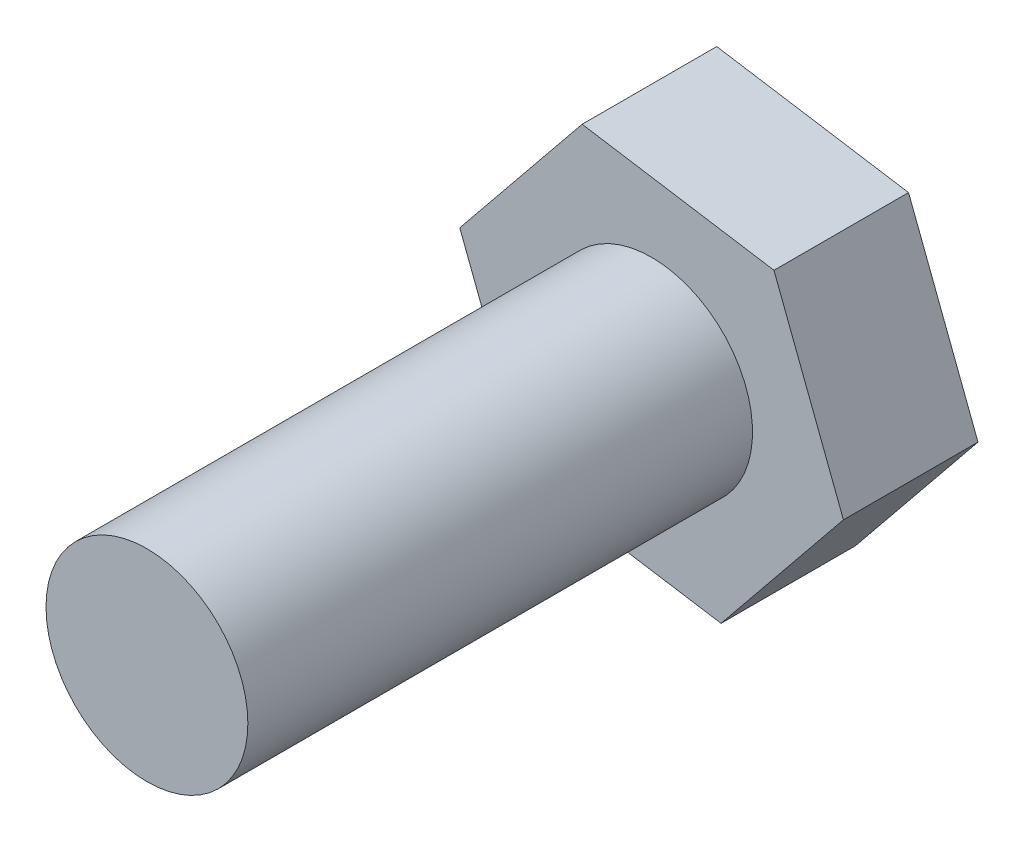
ISO-10303-21;
HEADER;
FILE_DESCRIPTION(('STEP AP214'),'2;1');
FILE_NAME('part.step','',(''),(''),'','','');
FILE_SCHEMA(('AUTOMOTIVE_DESIGN { 1 0 10303 214 1 1 1 1 }'));
ENDSEC;
DATA;
#1=APPLICATION_CONTEXT('core data for automotive mechanical design processes');
#2=APPLICATION_PROTOCOL_DEFINITION('international standard','automotive_design',2000,#1);
#3=PRODUCT_CONTEXT('',#1,'mechanical');
#4=PRODUCT('Part','Part','',(#3));
#5=PRODUCT_RELATED_PRODUCT_CATEGORY('part','',(#4));
#6=PRODUCT_DEFINITION_FORMATION('','',#4);
#7=PRODUCT_DEFINITION_CONTEXT('part definition',#1,'design');
#8=PRODUCT_DEFINITION('design','',#6,#7);
#9=PRODUCT_DEFINITION_SHAPE('','',#8);
#10=(LENGTH_UNIT() NAMED_UNIT(*) SI_UNIT(.MILLI.,.METRE.));
#11=(NAMED_UNIT(*) PLANE_ANGLE_UNIT() SI_UNIT($,.RADIAN.));
#12=(NAMED_UNIT(*) SI_UNIT($,.STERADIAN.) SOLID_ANGLE_UNIT());
#13=UNCERTAINTY_MEASURE_WITH_UNIT(LENGTH_MEASURE(1.E-05),#10,'distance_accuracy_value','');
#14=(GEOMETRIC_REPRESENTATION_CONTEXT(3) GLOBAL_UNCERTAINTY_ASSIGNED_CONTEXT((#13)) GLOBAL_UNIT_ASSIGNED_CONTEXT((#10,
#11,#12)) REPRESENTATION_CONTEXT('',''));
#15=CARTESIAN_POINT('',(0.,0.,0.));
#16=DIRECTION('',(0.,0.,1.));
#17=DIRECTION('',(1.,0.,0.));
#18=AXIS2_PLACEMENT_3D('',#15,#16,#17);
#19=CARTESIAN_POINT('',(0.,0.,1.5));
#20=DIRECTION('',(0.,0.,-1.));
#21=DIRECTION('',(-1.,0.,0.));
#22=AXIS2_PLACEMENT_3D('',#19,#20,#21);
#23=CYLINDRICAL_SURFACE('',#22,0.3);
#24=CARTESIAN_POINT('',(0.,0.,1.5));
#25=DIRECTION('',(0.,0.,1.));
#26=DIRECTION('',(1.,0.,0.));
#27=AXIS2_PLACEMENT_3D('',#24,#25,#26);
#28=CIRCLE('',#27,0.3);
#29=CARTESIAN_POINT('',(0.3,0.,1.5));
#30=VERTEX_POINT('',#29);
#31=EDGE_CURVE('E11',#30,#30,#28,.T.);
#32=ORIENTED_EDGE('',*,*,#31,.F.);
#33=EDGE_LOOP('',(#32));
#34=FACE_BOUND('',#33,.T.);
#35=CARTESIAN_POINT('',(0.,0.,0.));
#36=DIRECTION('',(0.,0.,-1.));
#37=DIRECTION('',(-1.,0.,0.));
#38=AXIS2_PLACEMENT_3D('',#35,#36,#37);
#39=CIRCLE('',#38,0.3);
#40=CARTESIAN_POINT('',(-0.3,0.,0.));
#41=VERTEX_POINT('',#40);
#42=EDGE_CURVE('E39',#41,#41,#39,.T.);
#43=ORIENTED_EDGE('',*,*,#42,.F.);
#44=EDGE_LOOP('',(#43));
#45=FACE_BOUND('',#44,.T.);
#46=ADVANCED_FACE('F31',(#34,#45),#23,.T.);
#47=CARTESIAN_POINT('',(0.,0.,1.5));
#48=DIRECTION('',(0.,0.,1.));
#49=DIRECTION('',(1.,0.,0.));
#50=AXIS2_PLACEMENT_3D('',#47,#48,#49);
#51=PLANE('',#50);
#52=ORIENTED_EDGE('',*,*,#31,.T.);
#53=EDGE_LOOP('',(#52));
#54=FACE_BOUND('',#53,.T.);
#55=ADVANCED_FACE('F140',(#54),#51,.T.);
#56=CARTESIAN_POINT('',(-0.363723426972816,-0.448373284222514,0.));
#57=DIRECTION('',(0.,0.,-1.));
#58=DIRECTION('',(-1.,0.,0.));
#59=AXIS2_PLACEMENT_3D('',#56,#57,#58);
#60=PLANE('',#59);
#61=DIRECTION('',(-0.987553654043765,0.157282485944267,0.));
#62=VECTOR('',#61,1.);
#63=CARTESIAN_POINT('',(0.20644094102855,-0.53918036982125,0.));
#64=LINE('',#63,#62);
#65=CARTESIAN_POINT('',(0.20644094102855,-0.53918036982125,0.));
#66=VERTEX_POINT('',#65);
#67=CARTESIAN_POINT('',(-0.363723426972816,-0.448373284222514,0.));
#68=VERTEX_POINT('',#67);
#69=EDGE_CURVE('E116',#66,#68,#64,.T.);
#70=ORIENTED_EDGE('',*,*,#69,.F.);
#71=DIRECTION('',(-0.629987455419986,-0.776605309029916,0.));
#72=VECTOR('',#71,1.);
#73=CARTESIAN_POINT('',(0.570164368001366,-0.0908070855987361,0.));
#74=LINE('',#73,#72);
#75=CARTESIAN_POINT('',(0.570164368001366,-0.0908070855987361,0.));
#76=VERTEX_POINT('',#75);
#77=EDGE_CURVE('E76',#76,#66,#74,.T.);
#78=ORIENTED_EDGE('',*,*,#77,.F.);
#79=DIRECTION('',(0.357566198623778,-0.933887794974183,0.));
#80=VECTOR('',#79,1.);
#81=CARTESIAN_POINT('',(0.363723426972817,0.448373284222514,0.));
#82=LINE('',#81,#80);
#83=CARTESIAN_POINT('',(0.363723426972817,0.448373284222514,0.));
#84=VERTEX_POINT('',#83);
#85=EDGE_CURVE('E70',#84,#76,#82,.T.);
#86=ORIENTED_EDGE('',*,*,#85,.F.);
#87=DIRECTION('',(0.987553654043765,-0.157282485944267,0.));
#88=VECTOR('',#87,1.);
#89=CARTESIAN_POINT('',(-0.206440941028549,0.53918036982125,0.));
#90=LINE('',#89,#88);
#91=CARTESIAN_POINT('',(-0.206440941028549,0.53918036982125,0.));
#92=VERTEX_POINT('',#91);
#93=EDGE_CURVE('E106',#92,#84,#90,.T.);
#94=ORIENTED_EDGE('',*,*,#93,.F.);
#95=DIRECTION('',(0.629987455419987,0.776605309029915,0.));
#96=VECTOR('',#95,1.);
#97=CARTESIAN_POINT('',(-0.570164368001366,0.0908070855987362,0.));
#98=LINE('',#97,#96);
#99=CARTESIAN_POINT('',(-0.570164368001366,0.0908070855987362,0.));
#100=VERTEX_POINT('',#99);
#101=EDGE_CURVE('E121',#100,#92,#98,.T.);
#102=ORIENTED_EDGE('',*,*,#101,.F.);
#103=DIRECTION('',(-0.357566198623778,0.933887794974183,0.));
#104=VECTOR('',#103,1.);
#105=CARTESIAN_POINT('',(-0.363723426972816,-0.448373284222514,0.));
#106=LINE('',#105,#104);
#107=EDGE_CURVE('E119',#68,#100,#106,.T.);
#108=ORIENTED_EDGE('',*,*,#107,.F.);
#109=EDGE_LOOP('',(#70,#78,#86,#94,#102,#108));
#110=FACE_BOUND('',#109,.T.);
#111=ORIENTED_EDGE('',*,*,#42,.T.);
#112=EDGE_LOOP('',(#111));
#113=FACE_BOUND('',#112,.T.);
#114=ADVANCED_FACE('F137',(#110,#113),#60,.F.);
#115=CARTESIAN_POINT('',(0.20644094102855,-0.53918036982125,-0.4));
#116=DIRECTION('',(0.157282485944267,0.987553654043765,0.));
#117=DIRECTION('',(-0.987553654043765,0.157282485944267,0.));
#118=AXIS2_PLACEMENT_3D('',#115,#116,#117);
#119=PLANE('',#118);
#120=ORIENTED_EDGE('',*,*,#69,.T.);
#121=DIRECTION('',(0.,0.,1.));
#122=VECTOR('',#121,1.);
#123=CARTESIAN_POINT('',(-0.363723426972816,-0.448373284222514,-0.4));
#124=LINE('',#123,#122);
#125=CARTESIAN_POINT('',(-0.363723426972816,-0.448373284222514,-0.4));
#126=VERTEX_POINT('',#125);
#127=EDGE_CURVE('E133',#126,#68,#124,.T.);
#128=ORIENTED_EDGE('',*,*,#127,.F.);
#129=DIRECTION('',(-0.987553654043765,0.157282485944267,0.));
#130=VECTOR('',#129,1.);
#131=CARTESIAN_POINT('',(0.20644094102855,-0.53918036982125,-0.4));
#132=LINE('',#131,#130);
#133=CARTESIAN_POINT('',(0.20644094102855,-0.53918036982125,-0.4));
#134=VERTEX_POINT('',#133);
#135=EDGE_CURVE('E126',#134,#126,#132,.T.);
#136=ORIENTED_EDGE('',*,*,#135,.F.);
#137=DIRECTION('',(0.,0.,1.));
#138=VECTOR('',#137,1.);
#139=CARTESIAN_POINT('',(0.20644094102855,-0.53918036982125,-0.4));
#140=LINE('',#139,#138);
#141=EDGE_CURVE('E112',#134,#66,#140,.T.);
#142=ORIENTED_EDGE('',*,*,#141,.T.);
#143=EDGE_LOOP('',(#120,#128,#136,#142));
#144=FACE_BOUND('',#143,.T.);
#145=ADVANCED_FACE('F150',(#144),#119,.F.);
#146=CARTESIAN_POINT('',(-0.363723426972816,-0.448373284222514,-0.4));
#147=DIRECTION('',(0.933887794974183,0.357566198623778,0.));
#148=DIRECTION('',(-0.357566198623778,0.933887794974183,0.));
#149=AXIS2_PLACEMENT_3D('',#146,#147,#148);
#150=PLANE('',#149);
#151=ORIENTED_EDGE('',*,*,#107,.T.);
#152=DIRECTION('',(0.,0.,1.));
#153=VECTOR('',#152,1.);
#154=CARTESIAN_POINT('',(-0.570164368001366,0.0908070855987362,-0.4));
#155=LINE('',#154,#153);
#156=CARTESIAN_POINT('',(-0.570164368001366,0.0908070855987362,-0.4));
#157=VERTEX_POINT('',#156);
#158=EDGE_CURVE('E130',#157,#100,#155,.T.);
#159=ORIENTED_EDGE('',*,*,#158,.F.);
#160=DIRECTION('',(-0.357566198623778,0.933887794974183,0.));
#161=VECTOR('',#160,1.);
#162=CARTESIAN_POINT('',(-0.363723426972816,-0.448373284222514,-0.4));
#163=LINE('',#162,#161);
#164=EDGE_CURVE('E85',#126,#157,#163,.T.);
#165=ORIENTED_EDGE('',*,*,#164,.F.);
#166=ORIENTED_EDGE('',*,*,#127,.T.);
#167=EDGE_LOOP('',(#151,#159,#165,#166));
#168=FACE_BOUND('',#167,.T.);
#169=ADVANCED_FACE('F156',(#168),#150,.F.);
#170=CARTESIAN_POINT('',(-0.570164368001366,0.0908070855987362,-0.4));
#171=DIRECTION('',(0.776605309029915,-0.629987455419987,0.));
#172=DIRECTION('',(0.629987455419987,0.776605309029915,0.));
#173=AXIS2_PLACEMENT_3D('',#170,#171,#172);
#174=PLANE('',#173);
#175=ORIENTED_EDGE('',*,*,#101,.T.);
#176=DIRECTION('',(0.,0.,1.));
#177=VECTOR('',#176,1.);
#178=CARTESIAN_POINT('',(-0.206440941028549,0.53918036982125,-0.4));
#179=LINE('',#178,#177);
#180=CARTESIAN_POINT('',(-0.206440941028549,0.53918036982125,-0.4));
#181=VERTEX_POINT('',#180);
#182=EDGE_CURVE('E107',#181,#92,#179,.T.);
#183=ORIENTED_EDGE('',*,*,#182,.F.);
#184=DIRECTION('',(0.629987455419987,0.776605309029915,0.));
#185=VECTOR('',#184,1.);
#186=CARTESIAN_POINT('',(-0.570164368001366,0.0908070855987362,-0.4));
#187=LINE('',#186,#185);
#188=EDGE_CURVE('E98',#157,#181,#187,.T.);
#189=ORIENTED_EDGE('',*,*,#188,.F.);
#190=ORIENTED_EDGE('',*,*,#158,.T.);
#191=EDGE_LOOP('',(#175,#183,#189,#190));
#192=FACE_BOUND('',#191,.T.);
#193=ADVANCED_FACE('F160',(#192),#174,.F.);
#194=CARTESIAN_POINT('',(-0.206440941028549,0.53918036982125,-0.4));
#195=DIRECTION('',(-0.157282485944267,-0.987553654043765,0.));
#196=DIRECTION('',(0.987553654043765,-0.157282485944267,0.));
#197=AXIS2_PLACEMENT_3D('',#194,#195,#196);
#198=PLANE('',#197);
#199=ORIENTED_EDGE('',*,*,#93,.T.);
#200=DIRECTION('',(0.,0.,1.));
#201=VECTOR('',#200,1.);
#202=CARTESIAN_POINT('',(0.363723426972817,0.448373284222514,-0.4));
#203=LINE('',#202,#201);
#204=CARTESIAN_POINT('',(0.363723426972817,0.448373284222514,-0.4));
#205=VERTEX_POINT('',#204);
#206=EDGE_CURVE('E103',#205,#84,#203,.T.);
#207=ORIENTED_EDGE('',*,*,#206,.F.);
#208=DIRECTION('',(0.987553654043765,-0.157282485944267,0.));
#209=VECTOR('',#208,1.);
#210=CARTESIAN_POINT('',(-0.206440941028549,0.53918036982125,-0.4));
#211=LINE('',#210,#209);
#212=EDGE_CURVE('E92',#181,#205,#211,.T.);
#213=ORIENTED_EDGE('',*,*,#212,.F.);
#214=ORIENTED_EDGE('',*,*,#182,.T.);
#215=EDGE_LOOP('',(#199,#207,#213,#214));
#216=FACE_BOUND('',#215,.T.);
#217=ADVANCED_FACE('F104',(#216),#198,.F.);
#218=CARTESIAN_POINT('',(0.363723426972817,0.448373284222514,-0.4));
#219=DIRECTION('',(-0.933887794974183,-0.357566198623778,0.));
#220=DIRECTION('',(0.357566198623778,-0.933887794974183,0.));
#221=AXIS2_PLACEMENT_3D('',#218,#219,#220);
#222=PLANE('',#221);
#223=ORIENTED_EDGE('',*,*,#85,.T.);
#224=DIRECTION('',(0.,0.,1.));
#225=VECTOR('',#224,1.);
#226=CARTESIAN_POINT('',(0.570164368001366,-0.0908070855987361,-0.4));
#227=LINE('',#226,#225);
#228=CARTESIAN_POINT('',(0.570164368001366,-0.0908070855987361,-0.4));
#229=VERTEX_POINT('',#228);
#230=EDGE_CURVE('E108',#229,#76,#227,.T.);
#231=ORIENTED_EDGE('',*,*,#230,.F.);
#232=DIRECTION('',(0.357566198623778,-0.933887794974183,0.));
#233=VECTOR('',#232,1.);
#234=CARTESIAN_POINT('',(0.363723426972817,0.448373284222514,-0.4));
#235=LINE('',#234,#233);
#236=EDGE_CURVE('E96',#205,#229,#235,.T.);
#237=ORIENTED_EDGE('',*,*,#236,.F.);
#238=ORIENTED_EDGE('',*,*,#206,.T.);
#239=EDGE_LOOP('',(#223,#231,#237,#238));
#240=FACE_BOUND('',#239,.T.);
#241=ADVANCED_FACE('F110',(#240),#222,.F.);
#242=CARTESIAN_POINT('',(0.570164368001366,-0.0908070855987361,-0.4));
#243=DIRECTION('',(-0.776605309029916,0.629987455419986,0.));
#244=DIRECTION('',(-0.629987455419986,-0.776605309029916,0.));
#245=AXIS2_PLACEMENT_3D('',#242,#243,#244);
#246=PLANE('',#245);
#247=ORIENTED_EDGE('',*,*,#77,.T.);
#248=ORIENTED_EDGE('',*,*,#141,.F.);
#249=DIRECTION('',(-0.629987455419986,-0.776605309029916,0.));
#250=VECTOR('',#249,1.);
#251=CARTESIAN_POINT('',(0.570164368001366,-0.0908070855987361,-0.4));
#252=LINE('',#251,#250);
#253=EDGE_CURVE('E47',#229,#134,#252,.T.);
#254=ORIENTED_EDGE('',*,*,#253,.F.);
#255=ORIENTED_EDGE('',*,*,#230,.T.);
#256=EDGE_LOOP('',(#247,#248,#254,#255));
#257=FACE_BOUND('',#256,.T.);
#258=ADVANCED_FACE('F168',(#257),#246,.F.);
#259=CARTESIAN_POINT('',(-0.363723426972816,-0.448373284222514,-0.4));
#260=DIRECTION('',(0.,0.,-1.));
#261=DIRECTION('',(-1.,0.,0.));
#262=AXIS2_PLACEMENT_3D('',#259,#260,#261);
#263=PLANE('',#262);
#264=ORIENTED_EDGE('',*,*,#135,.T.);
#265=ORIENTED_EDGE('',*,*,#164,.T.);
#266=ORIENTED_EDGE('',*,*,#188,.T.);
#267=ORIENTED_EDGE('',*,*,#212,.T.);
#268=ORIENTED_EDGE('',*,*,#236,.T.);
#269=ORIENTED_EDGE('',*,*,#253,.T.);
#270=EDGE_LOOP('',(#264,#265,#266,#267,#268,#269));
#271=FACE_BOUND('',#270,.T.);
#272=ADVANCED_FACE('F94',(#271),#263,.T.);
#273=CLOSED_SHELL('',(#46,#55,#114,#145,#169,#193,#217,#241,#258,#272));
#274=MANIFOLD_SOLID_BREP('B2',#273);
#275=ADVANCED_BREP_SHAPE_REPRESENTATION('',(#18,#274),#14);
#276=SHAPE_DEFINITION_REPRESENTATION(#9,#275);
ENDSEC;
END-ISO-10303-21;
